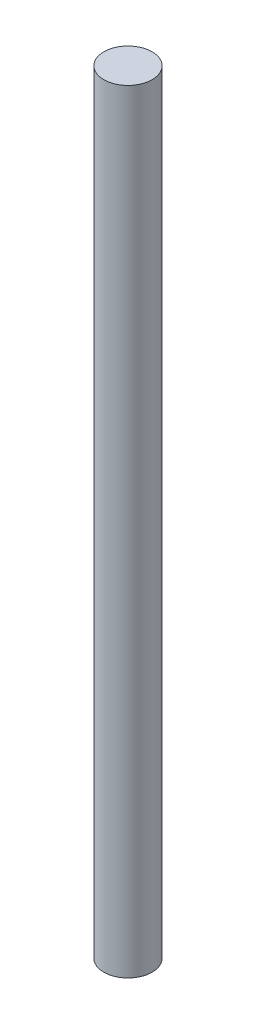
ISO-10303-21;
HEADER;
FILE_DESCRIPTION(('STEP AP214'),'2;1');
FILE_NAME('part.step','',(''),(''),'','','');
FILE_SCHEMA(('AUTOMOTIVE_DESIGN { 1 0 10303 214 1 1 1 1 }'));
ENDSEC;
DATA;
#1=APPLICATION_CONTEXT('core data for automotive mechanical design processes');
#2=APPLICATION_PROTOCOL_DEFINITION('international standard','automotive_design',2000,#1);
#3=PRODUCT_CONTEXT('',#1,'mechanical');
#4=PRODUCT('Part','Part','',(#3));
#5=PRODUCT_RELATED_PRODUCT_CATEGORY('part','',(#4));
#6=PRODUCT_DEFINITION_FORMATION('','',#4);
#7=PRODUCT_DEFINITION_CONTEXT('part definition',#1,'design');
#8=PRODUCT_DEFINITION('design','',#6,#7);
#9=PRODUCT_DEFINITION_SHAPE('','',#8);
#10=(LENGTH_UNIT() NAMED_UNIT(*) SI_UNIT(.MILLI.,.METRE.));
#11=(NAMED_UNIT(*) PLANE_ANGLE_UNIT() SI_UNIT($,.RADIAN.));
#12=(NAMED_UNIT(*) SI_UNIT($,.STERADIAN.) SOLID_ANGLE_UNIT());
#13=UNCERTAINTY_MEASURE_WITH_UNIT(LENGTH_MEASURE(1.E-05),#10,'distance_accuracy_value','');
#14=(GEOMETRIC_REPRESENTATION_CONTEXT(3) GLOBAL_UNCERTAINTY_ASSIGNED_CONTEXT((#13)) GLOBAL_UNIT_ASSIGNED_CONTEXT((#10,
#11,#12)) REPRESENTATION_CONTEXT('',''));
#15=CARTESIAN_POINT('',(0.,0.,0.));
#16=DIRECTION('',(0.,0.,1.));
#17=DIRECTION('',(1.,0.,0.));
#18=AXIS2_PLACEMENT_3D('',#15,#16,#17);
#19=CARTESIAN_POINT('',(0.,50.8,0.));
#20=DIRECTION('',(0.,-1.,0.));
#21=DIRECTION('',(0.,0.,-1.));
#22=AXIS2_PLACEMENT_3D('',#19,#20,#21);
#23=CYLINDRICAL_SURFACE('',#22,1.5875);
#24=CARTESIAN_POINT('',(0.,50.8,0.));
#25=DIRECTION('',(0.,1.,0.));
#26=DIRECTION('',(0.,0.,1.));
#27=AXIS2_PLACEMENT_3D('',#24,#25,#26);
#28=CIRCLE('',#27,1.5875);
#29=CARTESIAN_POINT('',(0.,50.8,1.5875));
#30=VERTEX_POINT('',#29);
#31=EDGE_CURVE('E10',#30,#30,#28,.T.);
#32=ORIENTED_EDGE('',*,*,#31,.F.);
#33=EDGE_LOOP('',(#32));
#34=FACE_BOUND('',#33,.T.);
#35=CARTESIAN_POINT('',(0.,0.,0.));
#36=DIRECTION('',(0.,1.,0.));
#37=DIRECTION('',(0.,0.,1.));
#38=AXIS2_PLACEMENT_3D('',#35,#36,#37);
#39=CIRCLE('',#38,1.5875);
#40=CARTESIAN_POINT('',(0.,0.,1.5875));
#41=VERTEX_POINT('',#40);
#42=EDGE_CURVE('E36',#41,#41,#39,.T.);
#43=ORIENTED_EDGE('',*,*,#42,.T.);
#44=EDGE_LOOP('',(#43));
#45=FACE_BOUND('',#44,.T.);
#46=ADVANCED_FACE('F33',(#34,#45),#23,.T.);
#47=CARTESIAN_POINT('',(0.,50.8,0.));
#48=DIRECTION('',(0.,1.,0.));
#49=DIRECTION('',(0.,0.,1.));
#50=AXIS2_PLACEMENT_3D('',#47,#48,#49);
#51=PLANE('',#50);
#52=ORIENTED_EDGE('',*,*,#31,.T.);
#53=EDGE_LOOP('',(#52));
#54=FACE_BOUND('',#53,.T.);
#55=ADVANCED_FACE('F48',(#54),#51,.T.);
#56=CARTESIAN_POINT('',(0.,0.,0.));
#57=DIRECTION('',(0.,1.,0.));
#58=DIRECTION('',(0.,0.,1.));
#59=AXIS2_PLACEMENT_3D('',#56,#57,#58);
#60=PLANE('',#59);
#61=ORIENTED_EDGE('',*,*,#42,.F.);
#62=EDGE_LOOP('',(#61));
#63=FACE_BOUND('',#62,.T.);
#64=ADVANCED_FACE('F46',(#63),#60,.F.);
#65=CLOSED_SHELL('',(#46,#55,#64));
#66=MANIFOLD_SOLID_BREP('B2',#65);
#67=ADVANCED_BREP_SHAPE_REPRESENTATION('',(#18,#66),#14);
#68=SHAPE_DEFINITION_REPRESENTATION(#9,#67);
ENDSEC;
END-ISO-10303-21;
